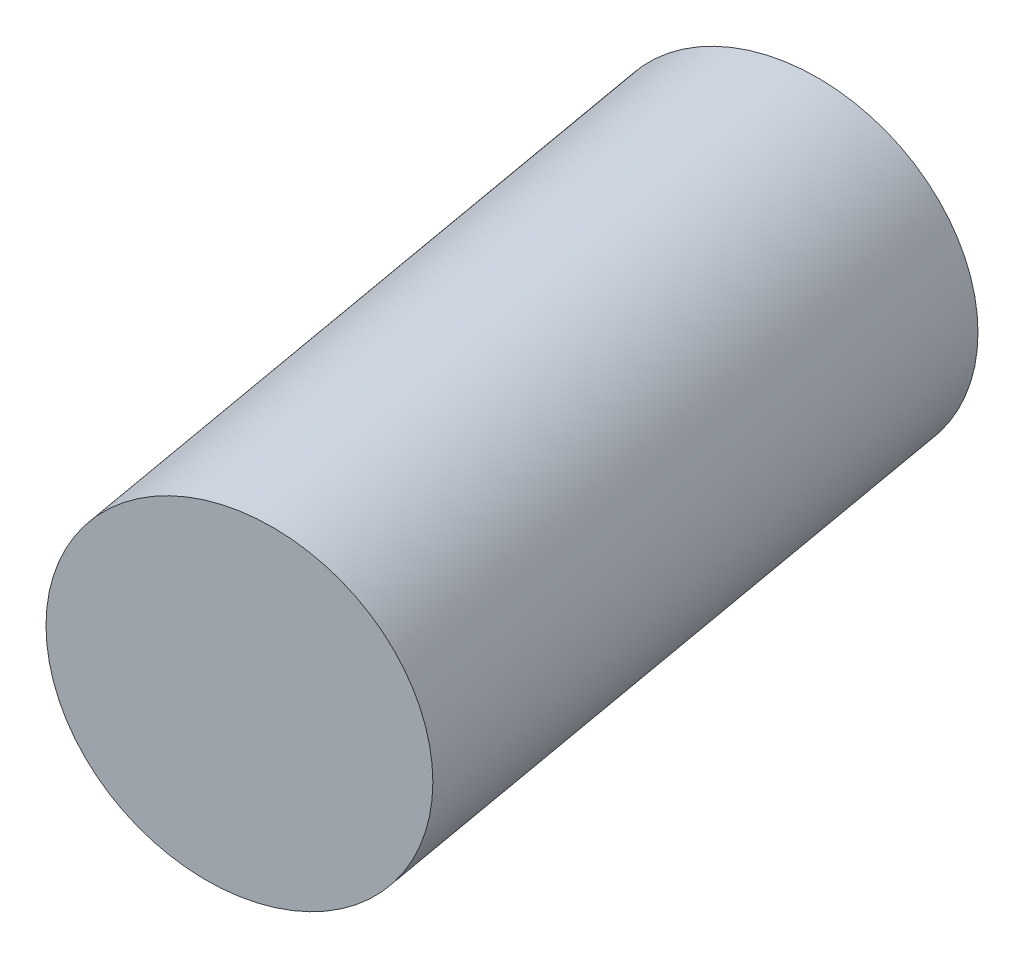
ISO-10303-21;
HEADER;
FILE_DESCRIPTION(('STEP AP214'),'2;1');
FILE_NAME('part.step','',(''),(''),'','','');
FILE_SCHEMA(('AUTOMOTIVE_DESIGN { 1 0 10303 214 1 1 1 1 }'));
ENDSEC;
DATA;
#1=APPLICATION_CONTEXT('core data for automotive mechanical design processes');
#2=APPLICATION_PROTOCOL_DEFINITION('international standard','automotive_design',2000,#1);
#3=PRODUCT_CONTEXT('',#1,'mechanical');
#4=PRODUCT('Part','Part','',(#3));
#5=PRODUCT_RELATED_PRODUCT_CATEGORY('part','',(#4));
#6=PRODUCT_DEFINITION_FORMATION('','',#4);
#7=PRODUCT_DEFINITION_CONTEXT('part definition',#1,'design');
#8=PRODUCT_DEFINITION('design','',#6,#7);
#9=PRODUCT_DEFINITION_SHAPE('','',#8);
#10=(LENGTH_UNIT() NAMED_UNIT(*) SI_UNIT(.MILLI.,.METRE.));
#11=(NAMED_UNIT(*) PLANE_ANGLE_UNIT() SI_UNIT($,.RADIAN.));
#12=(NAMED_UNIT(*) SI_UNIT($,.STERADIAN.) SOLID_ANGLE_UNIT());
#13=UNCERTAINTY_MEASURE_WITH_UNIT(LENGTH_MEASURE(1.E-05),#10,'distance_accuracy_value','');
#14=(GEOMETRIC_REPRESENTATION_CONTEXT(3) GLOBAL_UNCERTAINTY_ASSIGNED_CONTEXT((#13)) GLOBAL_UNIT_ASSIGNED_CONTEXT((#10,
#11,#12)) REPRESENTATION_CONTEXT('',''));
#15=CARTESIAN_POINT('',(0.,0.,0.));
#16=DIRECTION('',(0.,0.,1.));
#17=DIRECTION('',(1.,0.,0.));
#18=AXIS2_PLACEMENT_3D('',#15,#16,#17);
#19=CARTESIAN_POINT('',(-11.1156843038204,1.16430680382401E-13,4.48352085995661));
#20=DIRECTION('',(-0.173648177666927,0.,-0.984807753012209));
#21=DIRECTION('',(-0.984807753012209,0.,0.173648177666927));
#22=AXIS2_PLACEMENT_3D('',#19,#20,#21);
#23=PLANE('',#22);
#24=CARTESIAN_POINT('',(-11.1156843038204,1.16430680382401E-13,4.48352085995661));
#25=DIRECTION('',(0.173648177666927,0.,0.984807753012209));
#26=DIRECTION('',(0.984807753012209,0.,-0.173648177666927));
#27=AXIS2_PLACEMENT_3D('',#24,#25,#26);
#28=CIRCLE('',#27,1.93220030269667);
#29=CARTESIAN_POINT('',(-9.21283846535218,0.,4.14799779850585));
#30=VERTEX_POINT('',#29);
#31=EDGE_CURVE('E10',#30,#30,#28,.T.);
#32=ORIENTED_EDGE('',*,*,#31,.T.);
#33=EDGE_LOOP('',(#32));
#34=FACE_BOUND('',#33,.T.);
#35=ADVANCED_FACE('F15',(#34),#23,.F.);
#36=CARTESIAN_POINT('',(-10.9265332134386,1.1444942672799E-13,5.55625000000001));
#37=DIRECTION('',(0.173648177666927,0.,0.984807753012209));
#38=DIRECTION('',(0.984807753012209,0.,-0.173648177666927));
#39=AXIS2_PLACEMENT_3D('',#36,#37,#38);
#40=CYLINDRICAL_SURFACE('',#39,1.93220030269667);
#41=ORIENTED_EDGE('',*,*,#31,.F.);
#42=EDGE_LOOP('',(#41));
#43=FACE_BOUND('',#42,.T.);
#44=CARTESIAN_POINT('',(-12.4660881637494,1.30575418205561E-13,-3.175));
#45=DIRECTION('',(0.173648177666927,0.,0.984807753012209));
#46=DIRECTION('',(0.984807753012209,0.,-0.173648177666927));
#47=AXIS2_PLACEMENT_3D('',#44,#45,#46);
#48=CIRCLE('',#47,1.93220030269668);
#49=CARTESIAN_POINT('',(-10.5632423252812,1.10644154454257E-13,-3.51052306145076));
#50=VERTEX_POINT('',#49);
#51=EDGE_CURVE('E19',#50,#50,#48,.T.);
#52=ORIENTED_EDGE('',*,*,#51,.T.);
#53=EDGE_LOOP('',(#52));
#54=FACE_BOUND('',#53,.T.);
#55=ADVANCED_FACE('F28',(#43,#54),#40,.T.);
#56=CARTESIAN_POINT('',(-14.3689340022176,1.50506681956865E-13,-2.83947693854923));
#57=DIRECTION('',(0.173648177666927,0.,0.984807753012209));
#58=DIRECTION('',(0.984807753012209,0.,-0.173648177666927));
#59=AXIS2_PLACEMENT_3D('',#56,#57,#58);
#60=PLANE('',#59);
#61=ORIENTED_EDGE('',*,*,#51,.F.);
#62=EDGE_LOOP('',(#61));
#63=FACE_BOUND('',#62,.T.);
#64=ADVANCED_FACE('F17',(#63),#60,.F.);
#65=CLOSED_SHELL('',(#35,#55,#64));
#66=MANIFOLD_SOLID_BREP('B1',#65);
#67=ADVANCED_BREP_SHAPE_REPRESENTATION('',(#18,#66),#14);
#68=SHAPE_DEFINITION_REPRESENTATION(#9,#67);
ENDSEC;
END-ISO-10303-21;
